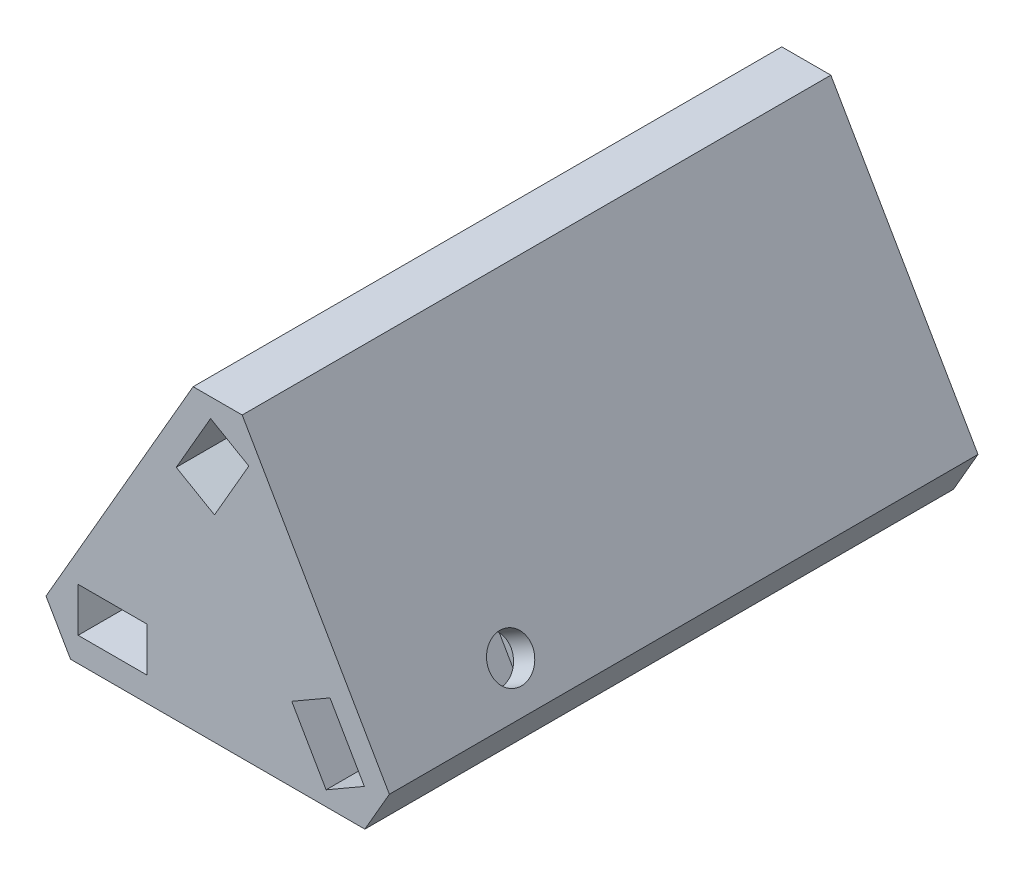
ISO-10303-21;
HEADER;
FILE_DESCRIPTION(('STEP AP214'),'2;1');
FILE_NAME('part.step','',(''),(''),'','','');
FILE_SCHEMA(('AUTOMOTIVE_DESIGN { 1 0 10303 214 1 1 1 1 }'));
ENDSEC;
DATA;
#1=APPLICATION_CONTEXT('core data for automotive mechanical design processes');
#2=APPLICATION_PROTOCOL_DEFINITION('international standard','automotive_design',2000,#1);
#3=PRODUCT_CONTEXT('',#1,'mechanical');
#4=PRODUCT('Part','Part','',(#3));
#5=PRODUCT_RELATED_PRODUCT_CATEGORY('part','',(#4));
#6=PRODUCT_DEFINITION_FORMATION('','',#4);
#7=PRODUCT_DEFINITION_CONTEXT('part definition',#1,'design');
#8=PRODUCT_DEFINITION('design','',#6,#7);
#9=PRODUCT_DEFINITION_SHAPE('','',#8);
#10=(LENGTH_UNIT() NAMED_UNIT(*) SI_UNIT(.MILLI.,.METRE.));
#11=(NAMED_UNIT(*) PLANE_ANGLE_UNIT() SI_UNIT($,.RADIAN.));
#12=(NAMED_UNIT(*) SI_UNIT($,.STERADIAN.) SOLID_ANGLE_UNIT());
#13=UNCERTAINTY_MEASURE_WITH_UNIT(LENGTH_MEASURE(1.E-05),#10,'distance_accuracy_value','');
#14=(GEOMETRIC_REPRESENTATION_CONTEXT(3) GLOBAL_UNCERTAINTY_ASSIGNED_CONTEXT((#13)) GLOBAL_UNIT_ASSIGNED_CONTEXT((#10,
#11,#12)) REPRESENTATION_CONTEXT('',''));
#15=CARTESIAN_POINT('',(0.,0.,0.));
#16=DIRECTION('',(0.,0.,1.));
#17=DIRECTION('',(1.,0.,0.));
#18=AXIS2_PLACEMENT_3D('',#15,#16,#17);
#19=CARTESIAN_POINT('',(0.,23.094010767585,60.));
#20=DIRECTION('',(0.866025403784439,-0.5,0.));
#21=DIRECTION('',(0.5,0.866025403784439,0.));
#22=AXIS2_PLACEMENT_3D('',#19,#20,#21);
#23=PLANE('',#22);
#24=CARTESIAN_POINT('',(-4.63675134594827,15.0629218543395,45.5));
#25=DIRECTION('',(-0.866025403784443,0.499999999999992,0.));
#26=DIRECTION('',(0.,0.,-1.));
#27=AXIS2_PLACEMENT_3D('',#24,#25,#26);
#28=CIRCLE('',#27,2.2);
#29=CARTESIAN_POINT('',(-4.63675134594827,15.0629218543395,43.3));
#30=VERTEX_POINT('',#29);
#31=EDGE_CURVE('E378',#30,#30,#28,.T.);
#32=ORIENTED_EDGE('',*,*,#31,.F.);
#33=EDGE_LOOP('',(#32));
#34=FACE_BOUND('',#33,.T.);
#35=DIRECTION('',(-0.5,-0.866025403784439,0.));
#36=VECTOR('',#35,1.);
#37=CARTESIAN_POINT('',(0.,23.094010767585,0.));
#38=LINE('',#37,#36);
#39=CARTESIAN_POINT('',(-2.50000000000002,18.7638837486628,0.));
#40=VERTEX_POINT('',#39);
#41=CARTESIAN_POINT('',(-17.5,-7.2168783648703,0.));
#42=VERTEX_POINT('',#41);
#43=EDGE_CURVE('E262',#40,#42,#38,.T.);
#44=ORIENTED_EDGE('',*,*,#43,.T.);
#45=DIRECTION('',(0.,0.,1.));
#46=VECTOR('',#45,1.);
#47=CARTESIAN_POINT('',(-17.5,-7.2168783648703,60.));
#48=LINE('',#47,#46);
#49=CARTESIAN_POINT('',(-17.5,-7.2168783648703,60.));
#50=VERTEX_POINT('',#49);
#51=EDGE_CURVE('E300',#42,#50,#48,.T.);
#52=ORIENTED_EDGE('',*,*,#51,.T.);
#53=DIRECTION('',(-0.5,-0.866025403784439,0.));
#54=VECTOR('',#53,1.);
#55=CARTESIAN_POINT('',(0.,23.094010767585,60.));
#56=LINE('',#55,#54);
#57=CARTESIAN_POINT('',(-2.50000000000002,18.7638837486628,60.));
#58=VERTEX_POINT('',#57);
#59=EDGE_CURVE('E269',#58,#50,#56,.T.);
#60=ORIENTED_EDGE('',*,*,#59,.F.);
#61=DIRECTION('',(0.,0.,-1.));
#62=VECTOR('',#61,1.);
#63=CARTESIAN_POINT('',(-2.50000000000002,18.7638837486628,60.));
#64=LINE('',#63,#62);
#65=EDGE_CURVE('E297',#58,#40,#64,.T.);
#66=ORIENTED_EDGE('',*,*,#65,.T.);
#67=EDGE_LOOP('',(#44,#52,#60,#66));
#68=FACE_BOUND('',#67,.T.);
#69=ADVANCED_FACE('F35',(#34,#68),#23,.F.);
#70=CARTESIAN_POINT('',(-20.,-11.5470053837925,60.));
#71=DIRECTION('',(0.,1.,0.));
#72=DIRECTION('',(0.,0.,1.));
#73=AXIS2_PLACEMENT_3D('',#70,#71,#72);
#74=PLANE('',#73);
#75=CARTESIAN_POINT('',(-10.7264973081038,-11.5470053837925,45.5));
#76=DIRECTION('',(0.,-1.,0.));
#77=DIRECTION('',(0.,0.,-1.));
#78=AXIS2_PLACEMENT_3D('',#75,#76,#77);
#79=CIRCLE('',#78,2.2);
#80=CARTESIAN_POINT('',(-10.7264973081038,-11.5470053837925,43.3));
#81=VERTEX_POINT('',#80);
#82=EDGE_CURVE('E225',#81,#81,#79,.T.);
#83=ORIENTED_EDGE('',*,*,#82,.F.);
#84=EDGE_LOOP('',(#83));
#85=FACE_BOUND('',#84,.T.);
#86=DIRECTION('',(1.,0.,0.));
#87=VECTOR('',#86,1.);
#88=CARTESIAN_POINT('',(-20.,-11.5470053837925,60.));
#89=LINE('',#88,#87);
#90=CARTESIAN_POINT('',(-15.,-11.5470053837925,60.));
#91=VERTEX_POINT('',#90);
#92=CARTESIAN_POINT('',(15.,-11.5470053837925,60.));
#93=VERTEX_POINT('',#92);
#94=EDGE_CURVE('E272',#91,#93,#89,.T.);
#95=ORIENTED_EDGE('',*,*,#94,.F.);
#96=DIRECTION('',(0.,0.,-1.));
#97=VECTOR('',#96,1.);
#98=CARTESIAN_POINT('',(-15.,-11.5470053837925,60.));
#99=LINE('',#98,#97);
#100=CARTESIAN_POINT('',(-15.,-11.5470053837925,0.));
#101=VERTEX_POINT('',#100);
#102=EDGE_CURVE('E288',#91,#101,#99,.T.);
#103=ORIENTED_EDGE('',*,*,#102,.T.);
#104=DIRECTION('',(1.,0.,0.));
#105=VECTOR('',#104,1.);
#106=CARTESIAN_POINT('',(-20.,-11.5470053837925,0.));
#107=LINE('',#106,#105);
#108=CARTESIAN_POINT('',(15.,-11.5470053837925,0.));
#109=VERTEX_POINT('',#108);
#110=EDGE_CURVE('E282',#101,#109,#107,.T.);
#111=ORIENTED_EDGE('',*,*,#110,.T.);
#112=DIRECTION('',(0.,0.,1.));
#113=VECTOR('',#112,1.);
#114=CARTESIAN_POINT('',(15.,-11.5470053837925,60.));
#115=LINE('',#114,#113);
#116=EDGE_CURVE('E279',#109,#93,#115,.T.);
#117=ORIENTED_EDGE('',*,*,#116,.T.);
#118=EDGE_LOOP('',(#95,#103,#111,#117));
#119=FACE_BOUND('',#118,.T.);
#120=ADVANCED_FACE('F335',(#85,#119),#74,.F.);
#121=CARTESIAN_POINT('',(20.,-11.5470053837925,60.));
#122=DIRECTION('',(-0.866025403784438,-0.5,0.));
#123=DIRECTION('',(0.5,-0.866025403784438,0.));
#124=AXIS2_PLACEMENT_3D('',#121,#122,#123);
#125=PLANE('',#124);
#126=CARTESIAN_POINT('',(15.3632486540519,-3.51591647054692,45.5));
#127=DIRECTION('',(0.866025403784436,0.500000000000004,0.));
#128=DIRECTION('',(0.,0.,-1.));
#129=AXIS2_PLACEMENT_3D('',#126,#127,#128);
#130=CIRCLE('',#129,2.2);
#131=CARTESIAN_POINT('',(15.3632486540519,-3.51591647054692,43.3));
#132=VERTEX_POINT('',#131);
#133=EDGE_CURVE('E373',#132,#132,#130,.T.);
#134=ORIENTED_EDGE('',*,*,#133,.F.);
#135=EDGE_LOOP('',(#134));
#136=FACE_BOUND('',#135,.T.);
#137=DIRECTION('',(-0.5,0.866025403784438,0.));
#138=VECTOR('',#137,1.);
#139=CARTESIAN_POINT('',(20.,-11.5470053837925,0.));
#140=LINE('',#139,#138);
#141=CARTESIAN_POINT('',(17.5,-7.21687836487033,0.));
#142=VERTEX_POINT('',#141);
#143=CARTESIAN_POINT('',(2.50000000000001,18.7638837486628,0.));
#144=VERTEX_POINT('',#143);
#145=EDGE_CURVE('E273',#142,#144,#140,.T.);
#146=ORIENTED_EDGE('',*,*,#145,.T.);
#147=DIRECTION('',(0.,0.,1.));
#148=VECTOR('',#147,1.);
#149=CARTESIAN_POINT('',(2.5,18.7638837486628,60.));
#150=LINE('',#149,#148);
#151=CARTESIAN_POINT('',(2.5,18.7638837486628,60.));
#152=VERTEX_POINT('',#151);
#153=EDGE_CURVE('E11',#144,#152,#150,.T.);
#154=ORIENTED_EDGE('',*,*,#153,.T.);
#155=DIRECTION('',(-0.5,0.866025403784438,0.));
#156=VECTOR('',#155,1.);
#157=CARTESIAN_POINT('',(20.,-11.5470053837925,60.));
#158=LINE('',#157,#156);
#159=CARTESIAN_POINT('',(17.5,-7.21687836487033,60.));
#160=VERTEX_POINT('',#159);
#161=EDGE_CURVE('E276',#160,#152,#158,.T.);
#162=ORIENTED_EDGE('',*,*,#161,.F.);
#163=DIRECTION('',(0.,0.,-1.));
#164=VECTOR('',#163,1.);
#165=CARTESIAN_POINT('',(17.5,-7.21687836487033,60.));
#166=LINE('',#165,#164);
#167=EDGE_CURVE('E43',#160,#142,#166,.T.);
#168=ORIENTED_EDGE('',*,*,#167,.T.);
#169=EDGE_LOOP('',(#146,#154,#162,#168));
#170=FACE_BOUND('',#169,.T.);
#171=ADVANCED_FACE('F312',(#136,#170),#125,.F.);
#172=CARTESIAN_POINT('',(-20.,-11.5470053837925,60.));
#173=DIRECTION('',(0.,0.,1.));
#174=DIRECTION('',(1.,0.,0.));
#175=AXIS2_PLACEMENT_3D('',#172,#173,#174);
#176=PLANE('',#175);
#177=DIRECTION('',(-0.866025403784443,0.499999999999992,0.));
#178=VECTOR('',#177,1.);
#179=CARTESIAN_POINT('',(3.17542648054281,14.5940107675851,60.));
#180=LINE('',#179,#178);
#181=CARTESIAN_POINT('',(3.17542648054281,14.5940107675851,60.));
#182=VERTEX_POINT('',#181);
#183=CARTESIAN_POINT('',(-0.721687836487184,16.844010767585,60.));
#184=VERTEX_POINT('',#183);
#185=EDGE_CURVE('E50',#182,#184,#180,.T.);
#186=ORIENTED_EDGE('',*,*,#185,.F.);
#187=DIRECTION('',(0.499999999999992,0.866025403784443,0.));
#188=VECTOR('',#187,1.);
#189=CARTESIAN_POINT('',(3.17542648054281,14.5940107675851,60.));
#190=LINE('',#189,#188);
#191=CARTESIAN_POINT('',(-0.324573519457135,8.53183294109397,60.));
#192=VERTEX_POINT('',#191);
#193=EDGE_CURVE('E179',#192,#182,#190,.T.);
#194=ORIENTED_EDGE('',*,*,#193,.F.);
#195=DIRECTION('',(0.866025403784443,-0.499999999999992,0.));
#196=VECTOR('',#195,1.);
#197=CARTESIAN_POINT('',(-0.324573519457135,8.53183294109397,60.));
#198=LINE('',#197,#196);
#199=CARTESIAN_POINT('',(-4.22168783648713,10.7818329410939,60.));
#200=VERTEX_POINT('',#199);
#201=EDGE_CURVE('E182',#200,#192,#198,.T.);
#202=ORIENTED_EDGE('',*,*,#201,.F.);
#203=DIRECTION('',(-0.499999999999992,-0.866025403784443,0.));
#204=VECTOR('',#203,1.);
#205=CARTESIAN_POINT('',(-0.721687836487185,16.844010767585,60.));
#206=LINE('',#205,#204);
#207=EDGE_CURVE('E191',#184,#200,#206,.T.);
#208=ORIENTED_EDGE('',*,*,#207,.F.);
#209=EDGE_LOOP('',(#186,#194,#202,#208));
#210=FACE_BOUND('',#209,.T.);
#211=DIRECTION('',(0.866025403784436,0.500000000000004,0.));
#212=VECTOR('',#211,1.);
#213=CARTESIAN_POINT('',(11.0510708275609,-10.0470053837925,60.));
#214=LINE('',#213,#212);
#215=CARTESIAN_POINT('',(11.0510708275609,-10.0470053837925,60.));
#216=VERTEX_POINT('',#215);
#217=CARTESIAN_POINT('',(14.9481851445908,-7.79700538379246,60.));
#218=VERTEX_POINT('',#217);
#219=EDGE_CURVE('E58',#216,#218,#214,.T.);
#220=ORIENTED_EDGE('',*,*,#219,.F.);
#221=DIRECTION('',(0.500000000000004,-0.866025403784436,0.));
#222=VECTOR('',#221,1.);
#223=CARTESIAN_POINT('',(11.0510708275609,-10.0470053837925,60.));
#224=LINE('',#223,#222);
#225=CARTESIAN_POINT('',(7.55107082756083,-3.98482755730142,60.));
#226=VERTEX_POINT('',#225);
#227=EDGE_CURVE('E204',#226,#216,#224,.T.);
#228=ORIENTED_EDGE('',*,*,#227,.F.);
#229=DIRECTION('',(-0.866025403784436,-0.500000000000004,0.));
#230=VECTOR('',#229,1.);
#231=CARTESIAN_POINT('',(7.55107082756083,-3.98482755730142,60.));
#232=LINE('',#231,#230);
#233=CARTESIAN_POINT('',(11.4481851445908,-1.7348275573014,60.));
#234=VERTEX_POINT('',#233);
#235=EDGE_CURVE('E218',#234,#226,#232,.T.);
#236=ORIENTED_EDGE('',*,*,#235,.F.);
#237=DIRECTION('',(-0.500000000000004,0.866025403784436,0.));
#238=VECTOR('',#237,1.);
#239=CARTESIAN_POINT('',(14.9481851445908,-7.79700538379246,60.));
#240=LINE('',#239,#238);
#241=EDGE_CURVE('E215',#218,#234,#240,.T.);
#242=ORIENTED_EDGE('',*,*,#241,.F.);
#243=EDGE_LOOP('',(#220,#228,#236,#242));
#244=FACE_BOUND('',#243,.T.);
#245=DIRECTION('',(0.,-1.,0.));
#246=VECTOR('',#245,1.);
#247=CARTESIAN_POINT('',(-14.2264973081038,-4.54700538379252,60.));
#248=LINE('',#247,#246);
#249=CARTESIAN_POINT('',(-14.2264973081038,-4.54700538379252,60.));
#250=VERTEX_POINT('',#249);
#251=CARTESIAN_POINT('',(-14.2264973081038,-9.04700538379252,60.));
#252=VERTEX_POINT('',#251);
#253=EDGE_CURVE('E236',#250,#252,#248,.T.);
#254=ORIENTED_EDGE('',*,*,#253,.F.);
#255=DIRECTION('',(-1.,0.,0.));
#256=VECTOR('',#255,1.);
#257=CARTESIAN_POINT('',(-14.2264973081038,-4.54700538379252,60.));
#258=LINE('',#257,#256);
#259=CARTESIAN_POINT('',(-7.22649730810375,-4.54700538379252,60.));
#260=VERTEX_POINT('',#259);
#261=EDGE_CURVE('E241',#260,#250,#258,.T.);
#262=ORIENTED_EDGE('',*,*,#261,.F.);
#263=DIRECTION('',(0.,1.,0.));
#264=VECTOR('',#263,1.);
#265=CARTESIAN_POINT('',(-7.22649730810375,-4.54700538379252,60.));
#266=LINE('',#265,#264);
#267=CARTESIAN_POINT('',(-7.22649730810375,-9.04700538379252,60.));
#268=VERTEX_POINT('',#267);
#269=EDGE_CURVE('E255',#268,#260,#266,.T.);
#270=ORIENTED_EDGE('',*,*,#269,.F.);
#271=DIRECTION('',(1.,0.,0.));
#272=VECTOR('',#271,1.);
#273=CARTESIAN_POINT('',(-14.2264973081038,-9.04700538379252,60.));
#274=LINE('',#273,#272);
#275=EDGE_CURVE('E252',#252,#268,#274,.T.);
#276=ORIENTED_EDGE('',*,*,#275,.F.);
#277=EDGE_LOOP('',(#254,#262,#270,#276));
#278=FACE_BOUND('',#277,.T.);
#279=ORIENTED_EDGE('',*,*,#59,.T.);
#280=DIRECTION('',(-0.499999999999997,0.86602540378444,0.));
#281=VECTOR('',#280,1.);
#282=CARTESIAN_POINT('',(-16.25,-9.38194187433142,60.));
#283=LINE('',#282,#281);
#284=EDGE_CURVE('E306',#50,#91,#283,.F.);
#285=ORIENTED_EDGE('',*,*,#284,.T.);
#286=ORIENTED_EDGE('',*,*,#94,.T.);
#287=DIRECTION('',(-0.500000000000001,-0.866025403784438,0.));
#288=VECTOR('',#287,1.);
#289=CARTESIAN_POINT('',(6.24999999999997,-26.7024499500202,60.));
#290=LINE('',#289,#288);
#291=EDGE_CURVE('E302',#93,#160,#290,.F.);
#292=ORIENTED_EDGE('',*,*,#291,.T.);
#293=ORIENTED_EDGE('',*,*,#161,.T.);
#294=DIRECTION('',(1.,0.,0.));
#295=VECTOR('',#294,1.);
#296=CARTESIAN_POINT('',(-20.,18.7638837486628,60.));
#297=LINE('',#296,#295);
#298=EDGE_CURVE('E304',#152,#58,#297,.F.);
#299=ORIENTED_EDGE('',*,*,#298,.T.);
#300=EDGE_LOOP('',(#279,#285,#286,#292,#293,#299));
#301=FACE_BOUND('',#300,.T.);
#302=ADVANCED_FACE('F329',(#210,#244,#278,#301),#176,.T.);
#303=CARTESIAN_POINT('',(-20.,-11.5470053837925,0.));
#304=DIRECTION('',(0.,0.,1.));
#305=DIRECTION('',(1.,0.,0.));
#306=AXIS2_PLACEMENT_3D('',#303,#304,#305);
#307=PLANE('',#306);
#308=ORIENTED_EDGE('',*,*,#110,.F.);
#309=DIRECTION('',(0.499999999999997,-0.86602540378444,0.));
#310=VECTOR('',#309,1.);
#311=CARTESIAN_POINT('',(-15.,-11.5470053837925,0.));
#312=LINE('',#311,#310);
#313=EDGE_CURVE('E295',#101,#42,#312,.F.);
#314=ORIENTED_EDGE('',*,*,#313,.T.);
#315=ORIENTED_EDGE('',*,*,#43,.F.);
#316=DIRECTION('',(-1.,0.,0.));
#317=VECTOR('',#316,1.);
#318=CARTESIAN_POINT('',(-2.50000000000002,18.7638837486628,0.));
#319=LINE('',#318,#317);
#320=EDGE_CURVE('E293',#40,#144,#319,.F.);
#321=ORIENTED_EDGE('',*,*,#320,.T.);
#322=ORIENTED_EDGE('',*,*,#145,.F.);
#323=DIRECTION('',(0.500000000000001,0.866025403784438,0.));
#324=VECTOR('',#323,1.);
#325=CARTESIAN_POINT('',(17.5,-7.21687836487033,0.));
#326=LINE('',#325,#324);
#327=EDGE_CURVE('E291',#142,#109,#326,.F.);
#328=ORIENTED_EDGE('',*,*,#327,.T.);
#329=EDGE_LOOP('',(#308,#314,#315,#321,#322,#328));
#330=FACE_BOUND('',#329,.T.);
#331=ADVANCED_FACE('F318',(#330),#307,.F.);
#332=CARTESIAN_POINT('',(-15.,-11.5470053837925,60.));
#333=DIRECTION('',(0.86602540378444,0.499999999999997,0.));
#334=DIRECTION('',(-0.499999999999997,0.86602540378444,0.));
#335=AXIS2_PLACEMENT_3D('',#332,#333,#334);
#336=PLANE('',#335);
#337=ORIENTED_EDGE('',*,*,#284,.F.);
#338=ORIENTED_EDGE('',*,*,#51,.F.);
#339=ORIENTED_EDGE('',*,*,#313,.F.);
#340=ORIENTED_EDGE('',*,*,#102,.F.);
#341=EDGE_LOOP('',(#337,#338,#339,#340));
#342=FACE_BOUND('',#341,.T.);
#343=ADVANCED_FACE('F333',(#342),#336,.F.);
#344=CARTESIAN_POINT('',(-2.50000000000002,18.7638837486628,60.));
#345=DIRECTION('',(0.,-1.,0.));
#346=DIRECTION('',(1.,0.,0.));
#347=AXIS2_PLACEMENT_3D('',#344,#345,#346);
#348=PLANE('',#347);
#349=ORIENTED_EDGE('',*,*,#298,.F.);
#350=ORIENTED_EDGE('',*,*,#153,.F.);
#351=ORIENTED_EDGE('',*,*,#320,.F.);
#352=ORIENTED_EDGE('',*,*,#65,.F.);
#353=EDGE_LOOP('',(#349,#350,#351,#352));
#354=FACE_BOUND('',#353,.T.);
#355=ADVANCED_FACE('F323',(#354),#348,.F.);
#356=CARTESIAN_POINT('',(17.5,-7.21687836487033,60.));
#357=DIRECTION('',(-0.866025403784438,0.500000000000001,0.));
#358=DIRECTION('',(-0.500000000000001,-0.866025403784438,0.));
#359=AXIS2_PLACEMENT_3D('',#356,#357,#358);
#360=PLANE('',#359);
#361=ORIENTED_EDGE('',*,*,#291,.F.);
#362=ORIENTED_EDGE('',*,*,#116,.F.);
#363=ORIENTED_EDGE('',*,*,#327,.F.);
#364=ORIENTED_EDGE('',*,*,#167,.F.);
#365=EDGE_LOOP('',(#361,#362,#363,#364));
#366=FACE_BOUND('',#365,.T.);
#367=ADVANCED_FACE('F37',(#366),#360,.F.);
#368=CARTESIAN_POINT('',(-14.2264973081038,-4.54700538379252,40.5));
#369=DIRECTION('',(-1.,0.,0.));
#370=DIRECTION('',(0.,0.,1.));
#371=AXIS2_PLACEMENT_3D('',#368,#369,#370);
#372=PLANE('',#371);
#373=ORIENTED_EDGE('',*,*,#253,.T.);
#374=DIRECTION('',(0.,0.,1.));
#375=VECTOR('',#374,1.);
#376=CARTESIAN_POINT('',(-14.2264973081038,-9.04700538379252,40.5));
#377=LINE('',#376,#375);
#378=CARTESIAN_POINT('',(-14.2264973081038,-9.04700538379252,40.5));
#379=VERTEX_POINT('',#378);
#380=EDGE_CURVE('E250',#379,#252,#377,.T.);
#381=ORIENTED_EDGE('',*,*,#380,.F.);
#382=DIRECTION('',(0.,-1.,0.));
#383=VECTOR('',#382,1.);
#384=CARTESIAN_POINT('',(-14.2264973081038,-4.54700538379252,40.5));
#385=LINE('',#384,#383);
#386=CARTESIAN_POINT('',(-14.2264973081038,-4.54700538379252,40.5));
#387=VERTEX_POINT('',#386);
#388=EDGE_CURVE('E237',#387,#379,#385,.T.);
#389=ORIENTED_EDGE('',*,*,#388,.F.);
#390=DIRECTION('',(0.,0.,1.));
#391=VECTOR('',#390,1.);
#392=CARTESIAN_POINT('',(-14.2264973081038,-4.54700538379252,40.5));
#393=LINE('',#392,#391);
#394=EDGE_CURVE('E260',#387,#250,#393,.T.);
#395=ORIENTED_EDGE('',*,*,#394,.T.);
#396=EDGE_LOOP('',(#373,#381,#389,#395));
#397=FACE_BOUND('',#396,.T.);
#398=ADVANCED_FACE('F338',(#397),#372,.F.);
#399=CARTESIAN_POINT('',(-14.2264973081038,-4.54700538379252,40.5));
#400=DIRECTION('',(0.,1.,0.));
#401=DIRECTION('',(-1.,0.,0.));
#402=AXIS2_PLACEMENT_3D('',#399,#400,#401);
#403=PLANE('',#402);
#404=ORIENTED_EDGE('',*,*,#261,.T.);
#405=ORIENTED_EDGE('',*,*,#394,.F.);
#406=DIRECTION('',(-1.,0.,0.));
#407=VECTOR('',#406,1.);
#408=CARTESIAN_POINT('',(-14.2264973081038,-4.54700538379252,40.5));
#409=LINE('',#408,#407);
#410=CARTESIAN_POINT('',(-7.22649730810375,-4.54700538379252,40.5));
#411=VERTEX_POINT('',#410);
#412=EDGE_CURVE('E247',#411,#387,#409,.T.);
#413=ORIENTED_EDGE('',*,*,#412,.F.);
#414=DIRECTION('',(0.,0.,1.));
#415=VECTOR('',#414,1.);
#416=CARTESIAN_POINT('',(-7.22649730810375,-4.54700538379252,40.5));
#417=LINE('',#416,#415);
#418=EDGE_CURVE('E263',#411,#260,#417,.T.);
#419=ORIENTED_EDGE('',*,*,#418,.T.);
#420=EDGE_LOOP('',(#404,#405,#413,#419));
#421=FACE_BOUND('',#420,.T.);
#422=ADVANCED_FACE('F343',(#421),#403,.F.);
#423=CARTESIAN_POINT('',(-7.22649730810375,-4.54700538379252,40.5));
#424=DIRECTION('',(1.,0.,0.));
#425=DIRECTION('',(0.,0.,-1.));
#426=AXIS2_PLACEMENT_3D('',#423,#424,#425);
#427=PLANE('',#426);
#428=ORIENTED_EDGE('',*,*,#269,.T.);
#429=ORIENTED_EDGE('',*,*,#418,.F.);
#430=DIRECTION('',(0.,1.,0.));
#431=VECTOR('',#430,1.);
#432=CARTESIAN_POINT('',(-7.22649730810375,-4.54700538379252,40.5));
#433=LINE('',#432,#431);
#434=CARTESIAN_POINT('',(-7.22649730810375,-9.04700538379252,40.5));
#435=VERTEX_POINT('',#434);
#436=EDGE_CURVE('E244',#435,#411,#433,.T.);
#437=ORIENTED_EDGE('',*,*,#436,.F.);
#438=DIRECTION('',(0.,0.,1.));
#439=VECTOR('',#438,1.);
#440=CARTESIAN_POINT('',(-7.22649730810375,-9.04700538379252,40.5));
#441=LINE('',#440,#439);
#442=EDGE_CURVE('E265',#435,#268,#441,.T.);
#443=ORIENTED_EDGE('',*,*,#442,.T.);
#444=EDGE_LOOP('',(#428,#429,#437,#443));
#445=FACE_BOUND('',#444,.T.);
#446=ADVANCED_FACE('F439',(#445),#427,.F.);
#447=CARTESIAN_POINT('',(-14.2264973081038,-9.04700538379252,40.5));
#448=DIRECTION('',(0.,-1.,0.));
#449=DIRECTION('',(0.,0.,-1.));
#450=AXIS2_PLACEMENT_3D('',#447,#448,#449);
#451=PLANE('',#450);
#452=CARTESIAN_POINT('',(-10.7264973081038,-9.04700538379252,45.5));
#453=DIRECTION('',(0.,-1.,0.));
#454=DIRECTION('',(0.,0.,-1.));
#455=AXIS2_PLACEMENT_3D('',#452,#453,#454);
#456=CIRCLE('',#455,2.2);
#457=CARTESIAN_POINT('',(-10.7264973081038,-9.04700538379252,43.3));
#458=VERTEX_POINT('',#457);
#459=EDGE_CURVE('E233',#458,#458,#456,.F.);
#460=ORIENTED_EDGE('',*,*,#459,.F.);
#461=EDGE_LOOP('',(#460));
#462=FACE_BOUND('',#461,.T.);
#463=ORIENTED_EDGE('',*,*,#275,.T.);
#464=ORIENTED_EDGE('',*,*,#442,.F.);
#465=DIRECTION('',(1.,0.,0.));
#466=VECTOR('',#465,1.);
#467=CARTESIAN_POINT('',(-14.2264973081038,-9.04700538379252,40.5));
#468=LINE('',#467,#466);
#469=EDGE_CURVE('E240',#379,#435,#468,.T.);
#470=ORIENTED_EDGE('',*,*,#469,.F.);
#471=ORIENTED_EDGE('',*,*,#380,.T.);
#472=EDGE_LOOP('',(#463,#464,#470,#471));
#473=FACE_BOUND('',#472,.T.);
#474=ADVANCED_FACE('F435',(#462,#473),#451,.F.);
#475=CARTESIAN_POINT('',(-14.2264973081038,-9.04700538379252,40.5));
#476=DIRECTION('',(0.,0.,1.));
#477=DIRECTION('',(1.,0.,0.));
#478=AXIS2_PLACEMENT_3D('',#475,#476,#477);
#479=PLANE('',#478);
#480=ORIENTED_EDGE('',*,*,#388,.T.);
#481=ORIENTED_EDGE('',*,*,#469,.T.);
#482=ORIENTED_EDGE('',*,*,#436,.T.);
#483=ORIENTED_EDGE('',*,*,#412,.T.);
#484=EDGE_LOOP('',(#480,#481,#482,#483));
#485=FACE_BOUND('',#484,.T.);
#486=ADVANCED_FACE('F431',(#485),#479,.T.);
#487=CARTESIAN_POINT('',(-10.7264973081038,-2.8244657093509,45.5));
#488=DIRECTION('',(0.,-1.,0.));
#489=DIRECTION('',(0.,0.,-1.));
#490=AXIS2_PLACEMENT_3D('',#487,#488,#489);
#491=CYLINDRICAL_SURFACE('',#490,2.2);
#492=ORIENTED_EDGE('',*,*,#459,.T.);
#493=EDGE_LOOP('',(#492));
#494=FACE_BOUND('',#493,.T.);
#495=ORIENTED_EDGE('',*,*,#82,.T.);
#496=EDGE_LOOP('',(#495));
#497=FACE_BOUND('',#496,.T.);
#498=ADVANCED_FACE('F428',(#494,#497),#491,.F.);
#499=CARTESIAN_POINT('',(11.0510708275609,-10.0470053837925,40.5));
#500=DIRECTION('',(0.500000000000004,-0.866025403784436,0.));
#501=DIRECTION('',(0.866025403784436,0.500000000000004,0.));
#502=AXIS2_PLACEMENT_3D('',#499,#500,#501);
#503=PLANE('',#502);
#504=ORIENTED_EDGE('',*,*,#219,.T.);
#505=DIRECTION('',(0.,0.,1.));
#506=VECTOR('',#505,1.);
#507=CARTESIAN_POINT('',(14.9481851445908,-7.79700538379246,40.5));
#508=LINE('',#507,#506);
#509=CARTESIAN_POINT('',(14.9481851445908,-7.79700538379246,40.5));
#510=VERTEX_POINT('',#509);
#511=EDGE_CURVE('E213',#510,#218,#508,.T.);
#512=ORIENTED_EDGE('',*,*,#511,.F.);
#513=DIRECTION('',(0.866025403784436,0.500000000000004,0.));
#514=VECTOR('',#513,1.);
#515=CARTESIAN_POINT('',(11.0510708275609,-10.0470053837925,40.5));
#516=LINE('',#515,#514);
#517=CARTESIAN_POINT('',(11.0510708275609,-10.0470053837925,40.5));
#518=VERTEX_POINT('',#517);
#519=EDGE_CURVE('E200',#518,#510,#516,.T.);
#520=ORIENTED_EDGE('',*,*,#519,.F.);
#521=DIRECTION('',(0.,0.,1.));
#522=VECTOR('',#521,1.);
#523=CARTESIAN_POINT('',(11.0510708275609,-10.0470053837925,40.5));
#524=LINE('',#523,#522);
#525=EDGE_CURVE('E223',#518,#216,#524,.T.);
#526=ORIENTED_EDGE('',*,*,#525,.T.);
#527=EDGE_LOOP('',(#504,#512,#520,#526));
#528=FACE_BOUND('',#527,.T.);
#529=ADVANCED_FACE('F418',(#528),#503,.F.);
#530=CARTESIAN_POINT('',(11.0510708275609,-10.0470053837925,40.5));
#531=DIRECTION('',(-0.866025403784436,-0.500000000000004,0.));
#532=DIRECTION('',(0.500000000000004,-0.866025403784436,0.));
#533=AXIS2_PLACEMENT_3D('',#530,#531,#532);
#534=PLANE('',#533);
#535=ORIENTED_EDGE('',*,*,#227,.T.);
#536=ORIENTED_EDGE('',*,*,#525,.F.);
#537=DIRECTION('',(0.500000000000004,-0.866025403784436,0.));
#538=VECTOR('',#537,1.);
#539=CARTESIAN_POINT('',(11.0510708275609,-10.0470053837925,40.5));
#540=LINE('',#539,#538);
#541=CARTESIAN_POINT('',(7.55107082756083,-3.98482755730142,40.5));
#542=VERTEX_POINT('',#541);
#543=EDGE_CURVE('E210',#542,#518,#540,.T.);
#544=ORIENTED_EDGE('',*,*,#543,.F.);
#545=DIRECTION('',(0.,0.,1.));
#546=VECTOR('',#545,1.);
#547=CARTESIAN_POINT('',(7.55107082756083,-3.98482755730142,40.5));
#548=LINE('',#547,#546);
#549=EDGE_CURVE('E226',#542,#226,#548,.T.);
#550=ORIENTED_EDGE('',*,*,#549,.T.);
#551=EDGE_LOOP('',(#535,#536,#544,#550));
#552=FACE_BOUND('',#551,.T.);
#553=ADVANCED_FACE('F414',(#552),#534,.F.);
#554=CARTESIAN_POINT('',(7.55107082756083,-3.98482755730142,40.5));
#555=DIRECTION('',(-0.500000000000004,0.866025403784436,0.));
#556=DIRECTION('',(-0.866025403784436,-0.500000000000004,0.));
#557=AXIS2_PLACEMENT_3D('',#554,#555,#556);
#558=PLANE('',#557);
#559=ORIENTED_EDGE('',*,*,#235,.T.);
#560=ORIENTED_EDGE('',*,*,#549,.F.);
#561=DIRECTION('',(-0.866025403784436,-0.500000000000004,0.));
#562=VECTOR('',#561,1.);
#563=CARTESIAN_POINT('',(7.55107082756083,-3.98482755730142,40.5));
#564=LINE('',#563,#562);
#565=CARTESIAN_POINT('',(11.4481851445908,-1.7348275573014,40.5));
#566=VERTEX_POINT('',#565);
#567=EDGE_CURVE('E207',#566,#542,#564,.T.);
#568=ORIENTED_EDGE('',*,*,#567,.F.);
#569=DIRECTION('',(0.,0.,1.));
#570=VECTOR('',#569,1.);
#571=CARTESIAN_POINT('',(11.4481851445908,-1.7348275573014,40.5));
#572=LINE('',#571,#570);
#573=EDGE_CURVE('E228',#566,#234,#572,.T.);
#574=ORIENTED_EDGE('',*,*,#573,.T.);
#575=EDGE_LOOP('',(#559,#560,#568,#574));
#576=FACE_BOUND('',#575,.T.);
#577=ADVANCED_FACE('F417',(#576),#558,.F.);
#578=CARTESIAN_POINT('',(14.9481851445908,-7.79700538379246,40.5));
#579=DIRECTION('',(0.866025403784436,0.500000000000004,0.));
#580=DIRECTION('',(-0.500000000000004,0.866025403784436,0.));
#581=AXIS2_PLACEMENT_3D('',#578,#579,#580);
#582=PLANE('',#581);
#583=CARTESIAN_POINT('',(13.1981851445908,-4.76591647054693,45.5));
#584=DIRECTION('',(0.866025403784436,0.500000000000004,0.));
#585=DIRECTION('',(-0.500000000000004,0.866025403784436,0.));
#586=AXIS2_PLACEMENT_3D('',#583,#584,#585);
#587=CIRCLE('',#586,2.2);
#588=CARTESIAN_POINT('',(12.0981851445908,-2.86066058222117,45.5));
#589=VERTEX_POINT('',#588);
#590=EDGE_CURVE('E185',#589,#589,#587,.F.);
#591=ORIENTED_EDGE('',*,*,#590,.F.);
#592=EDGE_LOOP('',(#591));
#593=FACE_BOUND('',#592,.T.);
#594=ORIENTED_EDGE('',*,*,#241,.T.);
#595=ORIENTED_EDGE('',*,*,#573,.F.);
#596=DIRECTION('',(-0.500000000000004,0.866025403784436,0.));
#597=VECTOR('',#596,1.);
#598=CARTESIAN_POINT('',(14.9481851445908,-7.79700538379246,40.5));
#599=LINE('',#598,#597);
#600=EDGE_CURVE('E203',#510,#566,#599,.T.);
#601=ORIENTED_EDGE('',*,*,#600,.F.);
#602=ORIENTED_EDGE('',*,*,#511,.T.);
#603=EDGE_LOOP('',(#594,#595,#601,#602));
#604=FACE_BOUND('',#603,.T.);
#605=ADVANCED_FACE('F412',(#593,#604),#582,.F.);
#606=CARTESIAN_POINT('',(14.9481851445908,-7.79700538379246,40.5));
#607=DIRECTION('',(0.,0.,1.));
#608=DIRECTION('',(-0.500000000000004,0.866025403784436,0.));
#609=AXIS2_PLACEMENT_3D('',#606,#607,#608);
#610=PLANE('',#609);
#611=ORIENTED_EDGE('',*,*,#519,.T.);
#612=ORIENTED_EDGE('',*,*,#600,.T.);
#613=ORIENTED_EDGE('',*,*,#567,.T.);
#614=ORIENTED_EDGE('',*,*,#543,.T.);
#615=EDGE_LOOP('',(#611,#612,#613,#614));
#616=FACE_BOUND('',#615,.T.);
#617=ADVANCED_FACE('F409',(#616),#610,.T.);
#618=CARTESIAN_POINT('',(3.17542648054281,14.5940107675851,40.5));
#619=DIRECTION('',(0.499999999999992,0.866025403784443,0.));
#620=DIRECTION('',(-0.866025403784443,0.499999999999992,0.));
#621=AXIS2_PLACEMENT_3D('',#618,#619,#620);
#622=PLANE('',#621);
#623=ORIENTED_EDGE('',*,*,#185,.T.);
#624=DIRECTION('',(0.,0.,1.));
#625=VECTOR('',#624,1.);
#626=CARTESIAN_POINT('',(-0.721687836487185,16.844010767585,40.5));
#627=LINE('',#626,#625);
#628=CARTESIAN_POINT('',(-0.721687836487185,16.844010767585,40.5));
#629=VERTEX_POINT('',#628);
#630=EDGE_CURVE('E157',#629,#184,#627,.T.);
#631=ORIENTED_EDGE('',*,*,#630,.F.);
#632=DIRECTION('',(-0.866025403784443,0.499999999999992,0.));
#633=VECTOR('',#632,1.);
#634=CARTESIAN_POINT('',(3.17542648054281,14.5940107675851,40.5));
#635=LINE('',#634,#633);
#636=CARTESIAN_POINT('',(3.17542648054281,14.5940107675851,40.5));
#637=VERTEX_POINT('',#636);
#638=EDGE_CURVE('E161',#637,#629,#635,.T.);
#639=ORIENTED_EDGE('',*,*,#638,.F.);
#640=DIRECTION('',(0.,0.,1.));
#641=VECTOR('',#640,1.);
#642=CARTESIAN_POINT('',(3.17542648054281,14.5940107675851,40.5));
#643=LINE('',#642,#641);
#644=EDGE_CURVE('E195',#637,#182,#643,.T.);
#645=ORIENTED_EDGE('',*,*,#644,.T.);
#646=EDGE_LOOP('',(#623,#631,#639,#645));
#647=FACE_BOUND('',#646,.T.);
#648=ADVANCED_FACE('F159',(#647),#622,.F.);
#649=CARTESIAN_POINT('',(3.17542648054281,14.5940107675851,40.5));
#650=DIRECTION('',(0.866025403784443,-0.499999999999992,0.));
#651=DIRECTION('',(0.499999999999992,0.866025403784443,0.));
#652=AXIS2_PLACEMENT_3D('',#649,#650,#651);
#653=PLANE('',#652);
#654=ORIENTED_EDGE('',*,*,#193,.T.);
#655=ORIENTED_EDGE('',*,*,#644,.F.);
#656=DIRECTION('',(0.499999999999992,0.866025403784443,0.));
#657=VECTOR('',#656,1.);
#658=CARTESIAN_POINT('',(3.17542648054281,14.5940107675851,40.5));
#659=LINE('',#658,#657);
#660=CARTESIAN_POINT('',(-0.324573519457135,8.53183294109397,40.5));
#661=VERTEX_POINT('',#660);
#662=EDGE_CURVE('E167',#661,#637,#659,.T.);
#663=ORIENTED_EDGE('',*,*,#662,.F.);
#664=DIRECTION('',(0.,0.,1.));
#665=VECTOR('',#664,1.);
#666=CARTESIAN_POINT('',(-0.324573519457135,8.53183294109397,40.5));
#667=LINE('',#666,#665);
#668=EDGE_CURVE('E197',#661,#192,#667,.T.);
#669=ORIENTED_EDGE('',*,*,#668,.T.);
#670=EDGE_LOOP('',(#654,#655,#663,#669));
#671=FACE_BOUND('',#670,.T.);
#672=ADVANCED_FACE('F396',(#671),#653,.F.);
#673=CARTESIAN_POINT('',(-0.324573519457135,8.53183294109397,40.5));
#674=DIRECTION('',(-0.499999999999992,-0.866025403784443,0.));
#675=DIRECTION('',(0.866025403784443,-0.499999999999992,0.));
#676=AXIS2_PLACEMENT_3D('',#673,#674,#675);
#677=PLANE('',#676);
#678=ORIENTED_EDGE('',*,*,#201,.T.);
#679=ORIENTED_EDGE('',*,*,#668,.F.);
#680=DIRECTION('',(0.866025403784443,-0.499999999999992,0.));
#681=VECTOR('',#680,1.);
#682=CARTESIAN_POINT('',(-0.324573519457135,8.53183294109397,40.5));
#683=LINE('',#682,#681);
#684=CARTESIAN_POINT('',(-4.22168783648713,10.7818329410939,40.5));
#685=VERTEX_POINT('',#684);
#686=EDGE_CURVE('E175',#685,#661,#683,.T.);
#687=ORIENTED_EDGE('',*,*,#686,.F.);
#688=DIRECTION('',(0.,0.,1.));
#689=VECTOR('',#688,1.);
#690=CARTESIAN_POINT('',(-4.22168783648713,10.7818329410939,40.5));
#691=LINE('',#690,#689);
#692=EDGE_CURVE('E166',#685,#200,#691,.T.);
#693=ORIENTED_EDGE('',*,*,#692,.T.);
#694=EDGE_LOOP('',(#678,#679,#687,#693));
#695=FACE_BOUND('',#694,.T.);
#696=ADVANCED_FACE('F399',(#695),#677,.F.);
#697=CARTESIAN_POINT('',(-0.721687836487185,16.844010767585,40.5));
#698=DIRECTION('',(-0.866025403784443,0.499999999999992,0.));
#699=DIRECTION('',(-0.499999999999992,-0.866025403784443,0.));
#700=AXIS2_PLACEMENT_3D('',#697,#698,#699);
#701=PLANE('',#700);
#702=CARTESIAN_POINT('',(-2.47168783648715,13.8129218543395,45.5));
#703=DIRECTION('',(-0.866025403784443,0.499999999999992,0.));
#704=DIRECTION('',(-0.499999999999992,-0.866025403784443,0.));
#705=AXIS2_PLACEMENT_3D('',#702,#703,#704);
#706=CIRCLE('',#705,2.2);
#707=CARTESIAN_POINT('',(-3.57168783648713,11.9076659660137,45.5));
#708=VERTEX_POINT('',#707);
#709=EDGE_CURVE('E375',#708,#708,#706,.F.);
#710=ORIENTED_EDGE('',*,*,#709,.F.);
#711=EDGE_LOOP('',(#710));
#712=FACE_BOUND('',#711,.T.);
#713=ORIENTED_EDGE('',*,*,#207,.T.);
#714=ORIENTED_EDGE('',*,*,#692,.F.);
#715=DIRECTION('',(-0.499999999999992,-0.866025403784443,0.));
#716=VECTOR('',#715,1.);
#717=CARTESIAN_POINT('',(-0.721687836487185,16.844010767585,40.5));
#718=LINE('',#717,#716);
#719=EDGE_CURVE('E170',#629,#685,#718,.T.);
#720=ORIENTED_EDGE('',*,*,#719,.F.);
#721=ORIENTED_EDGE('',*,*,#630,.T.);
#722=EDGE_LOOP('',(#713,#714,#720,#721));
#723=FACE_BOUND('',#722,.T.);
#724=ADVANCED_FACE('F171',(#712,#723),#701,.F.);
#725=CARTESIAN_POINT('',(-0.721687836487185,16.844010767585,40.5));
#726=DIRECTION('',(0.,0.,1.));
#727=DIRECTION('',(-0.499999999999992,-0.866025403784443,0.));
#728=AXIS2_PLACEMENT_3D('',#725,#726,#727);
#729=PLANE('',#728);
#730=ORIENTED_EDGE('',*,*,#638,.T.);
#731=ORIENTED_EDGE('',*,*,#719,.T.);
#732=ORIENTED_EDGE('',*,*,#686,.T.);
#733=ORIENTED_EDGE('',*,*,#662,.T.);
#734=EDGE_LOOP('',(#730,#731,#732,#733));
#735=FACE_BOUND('',#734,.T.);
#736=ADVANCED_FACE('F177',(#735),#729,.T.);
#737=CARTESIAN_POINT('',(-2.30019451605473,-13.7139101396237,45.5));
#738=DIRECTION('',(0.866025403784436,0.500000000000004,0.));
#739=DIRECTION('',(-0.500000000000004,0.866025403784436,0.));
#740=AXIS2_PLACEMENT_3D('',#737,#738,#739);
#741=CYLINDRICAL_SURFACE('',#740,2.2);
#742=ORIENTED_EDGE('',*,*,#590,.T.);
#743=EDGE_LOOP('',(#742));
#744=FACE_BOUND('',#743,.T.);
#745=ORIENTED_EDGE('',*,*,#133,.T.);
#746=EDGE_LOOP('',(#745));
#747=FACE_BOUND('',#746,.T.);
#748=ADVANCED_FACE('F385',(#744,#747),#741,.F.);
#749=CARTESIAN_POINT('',(45.2061837484706,-13.7139101396237,45.5));
#750=DIRECTION('',(-0.866025403784443,0.499999999999992,0.));
#751=DIRECTION('',(-0.499999999999992,-0.866025403784443,0.));
#752=AXIS2_PLACEMENT_3D('',#749,#750,#751);
#753=CYLINDRICAL_SURFACE('',#752,2.2);
#754=ORIENTED_EDGE('',*,*,#709,.T.);
#755=EDGE_LOOP('',(#754));
#756=FACE_BOUND('',#755,.T.);
#757=ORIENTED_EDGE('',*,*,#31,.T.);
#758=EDGE_LOOP('',(#757));
#759=FACE_BOUND('',#758,.T.);
#760=ADVANCED_FACE('F383',(#756,#759),#753,.F.);
#761=CLOSED_SHELL('',(#69,#120,#171,#302,#331,#343,#355,#367,#398,#422,#446,#474,#486,#498,#529,
#553,#577,#605,#617,#648,#672,#696,#724,#736,#748,#760));
#762=MANIFOLD_SOLID_BREP('B2',#761);
#763=ADVANCED_BREP_SHAPE_REPRESENTATION('',(#18,#762),#14);
#764=SHAPE_DEFINITION_REPRESENTATION(#9,#763);
ENDSEC;
END-ISO-10303-21;
